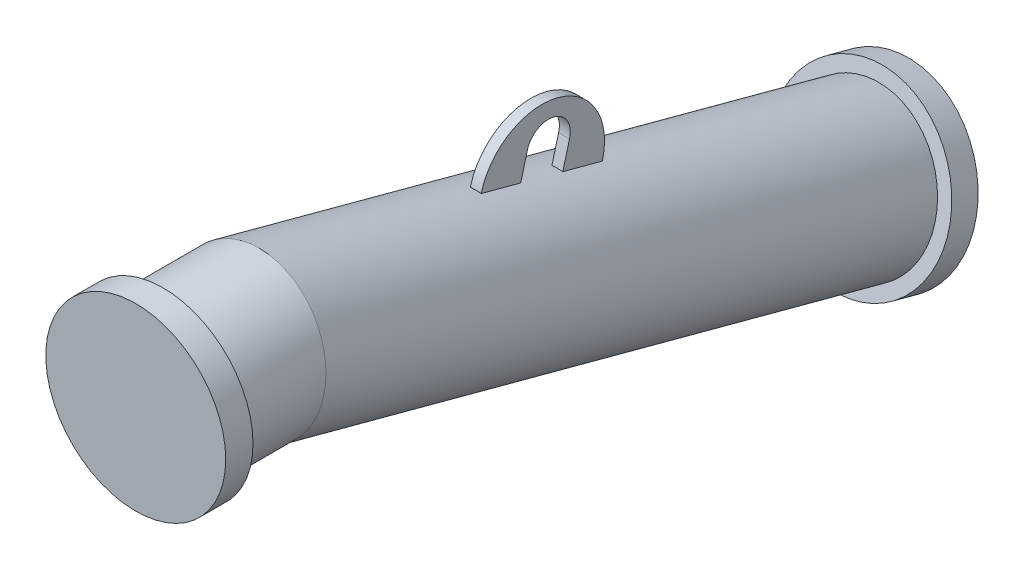
ISO-10303-21;
HEADER;
FILE_DESCRIPTION(('STEP AP214'),'2;1');
FILE_NAME('part.step','',(''),(''),'','','');
FILE_SCHEMA(('AUTOMOTIVE_DESIGN { 1 0 10303 214 1 1 1 1 }'));
ENDSEC;
DATA;
#1=APPLICATION_CONTEXT('core data for automotive mechanical design processes');
#2=APPLICATION_PROTOCOL_DEFINITION('international standard','automotive_design',2000,#1);
#3=PRODUCT_CONTEXT('',#1,'mechanical');
#4=PRODUCT('Part','Part','',(#3));
#5=PRODUCT_RELATED_PRODUCT_CATEGORY('part','',(#4));
#6=PRODUCT_DEFINITION_FORMATION('','',#4);
#7=PRODUCT_DEFINITION_CONTEXT('part definition',#1,'design');
#8=PRODUCT_DEFINITION('design','',#6,#7);
#9=PRODUCT_DEFINITION_SHAPE('','',#8);
#10=(LENGTH_UNIT() NAMED_UNIT(*) SI_UNIT(.MILLI.,.METRE.));
#11=(NAMED_UNIT(*) PLANE_ANGLE_UNIT() SI_UNIT($,.RADIAN.));
#12=(NAMED_UNIT(*) SI_UNIT($,.STERADIAN.) SOLID_ANGLE_UNIT());
#13=UNCERTAINTY_MEASURE_WITH_UNIT(LENGTH_MEASURE(1.E-05),#10,'distance_accuracy_value','');
#14=(GEOMETRIC_REPRESENTATION_CONTEXT(3) GLOBAL_UNCERTAINTY_ASSIGNED_CONTEXT((#13)) GLOBAL_UNIT_ASSIGNED_CONTEXT((#10,
#11,#12)) REPRESENTATION_CONTEXT('',''));
#15=CARTESIAN_POINT('',(0.,0.,0.));
#16=DIRECTION('',(0.,0.,1.));
#17=DIRECTION('',(1.,0.,0.));
#18=AXIS2_PLACEMENT_3D('',#15,#16,#17);
#19=CARTESIAN_POINT('',(-4.33536454895473E-11,-156.324502905385,-687.40248586322));
#20=DIRECTION('',(0.,-0.258819045102499,-0.965925826288988));
#21=DIRECTION('',(-1.00000000000005,0.,0.));
#22=AXIS2_PLACEMENT_3D('',#19,#20,#21);
#23=PLANE('',#22);
#24=CARTESIAN_POINT('',(-4.33536454895473E-11,-156.324502905385,-687.40248586322));
#25=DIRECTION('',(0.,-0.258819045102499,-0.965925826288988));
#26=DIRECTION('',(-1.00000000000005,0.,0.));
#27=AXIS2_PLACEMENT_3D('',#24,#25,#26);
#28=CIRCLE('',#27,82.5);
#29=CARTESIAN_POINT('',(-82.5000000000478,-156.324502905386,-687.402485863219));
#30=VERTEX_POINT('',#29);
#31=EDGE_CURVE('E20',#30,#30,#28,.T.);
#32=ORIENTED_EDGE('',*,*,#31,.T.);
#33=EDGE_LOOP('',(#32));
#34=FACE_BOUND('',#33,.T.);
#35=ADVANCED_FACE('F16',(#34),#23,.T.);
#36=CARTESIAN_POINT('',(-6.34812820856679E-13,-149.854026777807,-663.254340205998));
#37=DIRECTION('',(0.,-0.258819045102499,-0.965925826288988));
#38=DIRECTION('',(-1.00000000000005,0.,0.));
#39=AXIS2_PLACEMENT_3D('',#36,#37,#38);
#40=CYLINDRICAL_SURFACE('',#39,82.5);
#41=CARTESIAN_POINT('',(-6.34812820856679E-13,-149.854026777807,-663.254340205998));
#42=DIRECTION('',(0.,-0.258819045102499,-0.965925826288988));
#43=DIRECTION('',(-1.00000000000005,0.,0.));
#44=AXIS2_PLACEMENT_3D('',#41,#42,#43);
#45=CIRCLE('',#44,82.5);
#46=CARTESIAN_POINT('',(-82.5000000000051,-149.854026777808,-663.254340205997));
#47=VERTEX_POINT('',#46);
#48=EDGE_CURVE('E27',#47,#47,#45,.T.);
#49=ORIENTED_EDGE('',*,*,#48,.T.);
#50=EDGE_LOOP('',(#49));
#51=FACE_BOUND('',#50,.T.);
#52=ORIENTED_EDGE('',*,*,#31,.F.);
#53=EDGE_LOOP('',(#52));
#54=FACE_BOUND('',#53,.T.);
#55=ADVANCED_FACE('F18',(#51,#54),#40,.T.);
#56=CARTESIAN_POINT('',(-6.34812820856679E-13,-149.854026777807,-663.254340205998));
#57=DIRECTION('',(0.,-0.258819045102499,-0.965925826288988));
#58=DIRECTION('',(-1.00000000000005,0.,0.));
#59=AXIS2_PLACEMENT_3D('',#56,#57,#58);
#60=PLANE('',#59);
#61=CARTESIAN_POINT('',(-4.04398614430879E-11,-149.854026777835,-663.254340205991));
#62=DIRECTION('',(0.,0.258819045102523,0.965925826289025));
#63=DIRECTION('',(0.999999999999979,0.,0.));
#64=AXIS2_PLACEMENT_3D('',#61,#62,#63);
#65=CIRCLE('',#64,69.85);
#66=CARTESIAN_POINT('',(69.8499999999581,-149.854026777835,-663.254340205991));
#67=VERTEX_POINT('',#66);
#68=EDGE_CURVE('E10',#67,#67,#65,.T.);
#69=ORIENTED_EDGE('',*,*,#68,.F.);
#70=EDGE_LOOP('',(#69));
#71=FACE_BOUND('',#70,.T.);
#72=ORIENTED_EDGE('',*,*,#48,.F.);
#73=EDGE_LOOP('',(#72));
#74=FACE_BOUND('',#73,.T.);
#75=ADVANCED_FACE('F300',(#71,#74),#60,.F.);
#76=CARTESIAN_POINT('',(0.,0.,0.));
#77=DIRECTION('',(0.,0.,0.999999999999917));
#78=DIRECTION('',(1.00000000000005,0.,0.));
#79=AXIS2_PLACEMENT_3D('',#76,#77,#78);
#80=PLANE('',#79);
#81=CARTESIAN_POINT('',(0.,0.,0.));
#82=DIRECTION('',(0.,0.,0.999999999999917));
#83=DIRECTION('',(1.00000000000005,0.,0.));
#84=AXIS2_PLACEMENT_3D('',#81,#82,#83);
#85=CIRCLE('',#84,82.5);
#86=CARTESIAN_POINT('',(82.5000000000045,-8.30125381772403E-13,-2.88294578275769E-13));
#87=VERTEX_POINT('',#86);
#88=EDGE_CURVE('E278',#87,#87,#85,.T.);
#89=ORIENTED_EDGE('',*,*,#88,.T.);
#90=EDGE_LOOP('',(#89));
#91=FACE_BOUND('',#90,.T.);
#92=ADVANCED_FACE('F306',(#91),#80,.T.);
#93=CARTESIAN_POINT('',(-4.26333975374988E-11,1.61815005839117E-11,-24.9999999999994));
#94=DIRECTION('',(0.,0.,0.999999999999917));
#95=DIRECTION('',(1.00000000000005,0.,0.));
#96=AXIS2_PLACEMENT_3D('',#93,#94,#95);
#97=CYLINDRICAL_SURFACE('',#96,82.5);
#98=CARTESIAN_POINT('',(-4.26333975374988E-11,1.61815005839117E-11,-24.9999999999994));
#99=DIRECTION('',(0.,0.,0.999999999999917));
#100=DIRECTION('',(1.00000000000005,0.,0.));
#101=AXIS2_PLACEMENT_3D('',#98,#99,#100);
#102=CIRCLE('',#101,82.5);
#103=CARTESIAN_POINT('',(82.4999999999618,1.53513752021393E-11,-24.9999999999996));
#104=VERTEX_POINT('',#103);
#105=EDGE_CURVE('E252',#104,#104,#102,.T.);
#106=ORIENTED_EDGE('',*,*,#105,.T.);
#107=EDGE_LOOP('',(#106));
#108=FACE_BOUND('',#107,.T.);
#109=ORIENTED_EDGE('',*,*,#88,.F.);
#110=EDGE_LOOP('',(#109));
#111=FACE_BOUND('',#110,.T.);
#112=ADVANCED_FACE('F316',(#108,#111),#97,.T.);
#113=CARTESIAN_POINT('',(-4.26333975374988E-11,1.61815005839117E-11,-24.9999999999994));
#114=DIRECTION('',(0.,0.,0.999999999999917));
#115=DIRECTION('',(1.00000000000005,0.,0.));
#116=AXIS2_PLACEMENT_3D('',#113,#114,#115);
#117=PLANE('',#116);
#118=CARTESIAN_POINT('',(0.,0.,-24.999999999999));
#119=DIRECTION('',(0.,0.,-0.999999999999964));
#120=DIRECTION('',(-0.999999999999976,0.,0.));
#121=AXIS2_PLACEMENT_3D('',#118,#119,#120);
#122=CIRCLE('',#121,69.85);
#123=CARTESIAN_POINT('',(-69.8499999999983,-2.55500211454481E-13,-24.9999999999987));
#124=VERTEX_POINT('',#123);
#125=EDGE_CURVE('E249',#124,#124,#122,.T.);
#126=ORIENTED_EDGE('',*,*,#125,.F.);
#127=EDGE_LOOP('',(#126));
#128=FACE_BOUND('',#127,.T.);
#129=ORIENTED_EDGE('',*,*,#105,.F.);
#130=EDGE_LOOP('',(#129));
#131=FACE_BOUND('',#130,.T.);
#132=ADVANCED_FACE('F319',(#128,#131),#117,.F.);
#133=CARTESIAN_POINT('',(-4.04361456430874E-11,-129.409522551299,-586.954411696939));
#134=DIRECTION('',(0.,-0.258819045102523,-0.965925826289025));
#135=DIRECTION('',(-0.999999999999979,0.,0.));
#136=AXIS2_PLACEMENT_3D('',#133,#134,#135);
#137=CYLINDRICAL_SURFACE('',#136,69.85);
#138=CARTESIAN_POINT('',(-4.15916053734302E-11,-60.5614562174776,-330.009930136259));
#139=DIRECTION('',(0.,0.258819045102529,0.965925826289064));
#140=DIRECTION('',(0.,-0.965925826289066,0.25881904510253));
#141=AXIS2_PLACEMENT_3D('',#138,#139,#140);
#142=CIRCLE('',#141,69.85);
#143=CARTESIAN_POINT('',(4.999999999959,6.73538358774536,-348.042064015247));
#144=VERTEX_POINT('',#143);
#145=CARTESIAN_POINT('',(-5.000000000041,6.73538358774543,-348.042064015247));
#146=VERTEX_POINT('',#145);
#147=EDGE_CURVE('E268',#144,#146,#142,.T.);
#148=ORIENTED_EDGE('',*,*,#147,.F.);
#149=DIRECTION('',(0.,-0.258819045102523,-0.965925826289025));
#150=VECTOR('',#149,1.);
#151=CARTESIAN_POINT('',(4.99999999995958,-62.1126827460732,-604.986545575916));
#152=LINE('',#151,#150);
#153=CARTESIAN_POINT('',(4.99999999995958,16.4410977790958,-311.819845529398));
#154=VERTEX_POINT('',#153);
#155=EDGE_CURVE('E264',#144,#154,#152,.F.);
#156=ORIENTED_EDGE('',*,*,#155,.T.);
#157=CARTESIAN_POINT('',(-4.17544939264353E-11,-50.8557420261328,-293.787711650419));
#158=DIRECTION('',(0.,-0.258819045102529,-0.965925826289066));
#159=DIRECTION('',(0.,0.965925826289066,-0.258819045102529));
#160=AXIS2_PLACEMENT_3D('',#157,#158,#159);
#161=CIRCLE('',#160,69.85);
#162=CARTESIAN_POINT('',(-5.00000000004043,16.441097779096,-311.819845529398));
#163=VERTEX_POINT('',#162);
#164=EDGE_CURVE('E256',#163,#154,#161,.T.);
#165=ORIENTED_EDGE('',*,*,#164,.F.);
#166=DIRECTION('',(0.,-0.258819045102523,-0.965925826289025));
#167=VECTOR('',#166,1.);
#168=CARTESIAN_POINT('',(-5.00000000004043,-62.1126827460732,-604.986545575916));
#169=LINE('',#168,#167);
#170=EDGE_CURVE('E260',#146,#163,#169,.F.);
#171=ORIENTED_EDGE('',*,*,#170,.F.);
#172=EDGE_LOOP('',(#148,#156,#165,#171));
#173=FACE_BOUND('',#172,.T.);
#174=ORIENTED_EDGE('',*,*,#68,.T.);
#175=EDGE_LOOP('',(#174));
#176=FACE_BOUND('',#175,.T.);
#177=CARTESIAN_POINT('',(0.,-1.73056013963446E-11,-103.991498552409));
#178=DIRECTION('',(0.,-0.130526192220051,-0.991444861373775));
#179=DIRECTION('',(0.,-0.991444861373834,0.130526192220052));
#180=AXIS2_PLACEMENT_3D('',#177,#178,#179);
#181=ELLIPSE('',#180,70.4527328965237,69.85);
#182=CARTESIAN_POINT('',(-2.96148545480706E-13,-69.850000000019,-94.7955715959296));
#183=VERTEX_POINT('',#182);
#184=EDGE_CURVE('E247',#183,#183,#181,.T.);
#185=ORIENTED_EDGE('',*,*,#184,.T.);
#186=EDGE_LOOP('',(#185));
#187=FACE_BOUND('',#186,.T.);
#188=CARTESIAN_POINT('',(-4.14178575835581E-11,-70.9142180215791,-368.646963187822));
#189=DIRECTION('',(0.,-0.258819045102529,-0.965925826289064));
#190=DIRECTION('',(0.,0.965925826289066,-0.258819045102529));
#191=AXIS2_PLACEMENT_3D('',#188,#189,#190);
#192=CIRCLE('',#191,69.85);
#193=CARTESIAN_POINT('',(-5.00000000004092,-3.6173782163557,-386.679097066808));
#194=VERTEX_POINT('',#193);
#195=CARTESIAN_POINT('',(4.99999999995909,-3.61737821635567,-386.679097066808));
#196=VERTEX_POINT('',#195);
#197=EDGE_CURVE('E48',#194,#196,#192,.T.);
#198=ORIENTED_EDGE('',*,*,#197,.F.);
#199=CARTESIAN_POINT('',(-5.00000000004042,-13.3230924076954,-422.90131555264));
#200=VERTEX_POINT('',#199);
#201=EDGE_CURVE('E265',#200,#194,#169,.F.);
#202=ORIENTED_EDGE('',*,*,#201,.F.);
#203=CARTESIAN_POINT('',(-4.1254969030553E-11,-80.6199322129241,-404.869181673662));
#204=DIRECTION('',(0.,0.258819045102529,0.965925826289066));
#205=DIRECTION('',(0.,-0.965925826289066,0.258819045102529));
#206=AXIS2_PLACEMENT_3D('',#203,#204,#205);
#207=CIRCLE('',#206,69.85);
#208=CARTESIAN_POINT('',(4.99999999995958,-13.3230924076955,-422.90131555264));
#209=VERTEX_POINT('',#208);
#210=EDGE_CURVE('E272',#209,#200,#207,.T.);
#211=ORIENTED_EDGE('',*,*,#210,.F.);
#212=EDGE_CURVE('E40',#209,#196,#152,.F.);
#213=ORIENTED_EDGE('',*,*,#212,.T.);
#214=EDGE_LOOP('',(#198,#202,#211,#213));
#215=FACE_BOUND('',#214,.T.);
#216=ADVANCED_FACE('F325',(#173,#176,#187,#215),#137,.T.);
#217=CARTESIAN_POINT('',(0.,-1.73056013963446E-11,-103.991498552409));
#218=DIRECTION('',(0.,0.,0.999999999999964));
#219=DIRECTION('',(0.999999999999976,0.,0.));
#220=AXIS2_PLACEMENT_3D('',#217,#218,#219);
#221=CYLINDRICAL_SURFACE('',#220,69.85);
#222=ORIENTED_EDGE('',*,*,#125,.T.);
#223=EDGE_LOOP('',(#222));
#224=FACE_BOUND('',#223,.T.);
#225=ORIENTED_EDGE('',*,*,#184,.F.);
#226=EDGE_LOOP('',(#225));
#227=FACE_BOUND('',#226,.T.);
#228=ADVANCED_FACE('F327',(#224,#227),#221,.T.);
#229=CARTESIAN_POINT('',(4.99999999995958,24.576227638515,-373.528027379131));
#230=DIRECTION('',(1.,0.,0.));
#231=DIRECTION('',(0.,0.965925826289068,-0.25881904510253));
#232=AXIS2_PLACEMENT_3D('',#229,#230,#231);
#233=PLANE('',#232);
#234=ORIENTED_EDGE('',*,*,#212,.F.);
#235=DIRECTION('',(0.,0.965925826289066,-0.258819045102529));
#236=VECTOR('',#235,1.);
#237=CARTESIAN_POINT('',(4.99999999995958,-22.6643826355643,-420.398324379818));
#238=LINE('',#237,#236);
#239=CARTESIAN_POINT('',(4.99999999995958,-13.0051243726735,-422.986514830843));
#240=VERTEX_POINT('',#239);
#241=EDGE_CURVE('E198',#209,#240,#238,.T.);
#242=ORIENTED_EDGE('',*,*,#241,.T.);
#243=CARTESIAN_POINT('',(4.99999999995958,1.87697072072196,-367.445779819222));
#244=DIRECTION('',(1.,0.,0.));
#245=DIRECTION('',(0.,0.965925826289068,-0.25881904510253));
#246=AXIS2_PLACEMENT_3D('',#243,#244,#245);
#247=CIRCLE('',#246,57.5);
#248=CARTESIAN_POINT('',(4.99999999995958,16.7590658141172,-311.9050448076));
#249=VERTEX_POINT('',#248);
#250=EDGE_CURVE('E216',#240,#249,#247,.T.);
#251=ORIENTED_EDGE('',*,*,#250,.T.);
#252=DIRECTION('',(0.,0.965925826289066,-0.258819045102529));
#253=VECTOR('',#252,1.);
#254=CARTESIAN_POINT('',(4.99999999995957,7.09980755122653,-309.316854356575));
#255=LINE('',#254,#253);
#256=EDGE_CURVE('E185',#154,#249,#255,.T.);
#257=ORIENTED_EDGE('',*,*,#256,.F.);
#258=ORIENTED_EDGE('',*,*,#155,.F.);
#259=DIRECTION('',(0.,0.965925826289068,-0.25881904510253));
#260=VECTOR('',#259,1.);
#261=CARTESIAN_POINT('',(4.99999999995958,7.05335162277241,-348.12726329344));
#262=LINE('',#261,#260);
#263=CARTESIAN_POINT('',(4.99999999995958,29.7526085405658,-354.20951085335));
#264=VERTEX_POINT('',#263);
#265=EDGE_CURVE('E205',#144,#264,#262,.T.);
#266=ORIENTED_EDGE('',*,*,#265,.T.);
#267=CARTESIAN_POINT('',(4.99999999995958,24.576227638515,-373.528027379131));
#268=DIRECTION('',(-1.,0.,0.));
#269=DIRECTION('',(0.,0.965925826289068,-0.25881904510253));
#270=AXIS2_PLACEMENT_3D('',#267,#268,#269);
#271=CIRCLE('',#270,20.);
#272=CARTESIAN_POINT('',(4.99999999995958,19.3998467364645,-392.846543904913));
#273=VERTEX_POINT('',#272);
#274=EDGE_CURVE('E208',#264,#273,#271,.T.);
#275=ORIENTED_EDGE('',*,*,#274,.T.);
#276=DIRECTION('',(0.,-0.965925826289068,0.25881904510253));
#277=VECTOR('',#276,1.);
#278=CARTESIAN_POINT('',(4.99999999995958,-3.29941018132864,-386.764296345003));
#279=LINE('',#278,#277);
#280=EDGE_CURVE('E212',#273,#196,#279,.T.);
#281=ORIENTED_EDGE('',*,*,#280,.T.);
#282=EDGE_LOOP('',(#234,#242,#251,#257,#258,#266,#275,#281));
#283=FACE_BOUND('',#282,.T.);
#284=ADVANCED_FACE('F330',(#283),#233,.T.);
#285=CARTESIAN_POINT('',(-5.00000000004042,24.576227638515,-373.528027379131));
#286=DIRECTION('',(1.,0.,0.));
#287=DIRECTION('',(0.,0.965925826289068,-0.25881904510253));
#288=AXIS2_PLACEMENT_3D('',#285,#286,#287);
#289=PLANE('',#288);
#290=DIRECTION('',(0.,0.965925826289066,-0.258819045102529));
#291=VECTOR('',#290,1.);
#292=CARTESIAN_POINT('',(-5.00000000004042,-22.6643826355643,-420.398324379818));
#293=LINE('',#292,#291);
#294=CARTESIAN_POINT('',(-5.00000000004042,-13.0051243726736,-422.986514830843));
#295=VERTEX_POINT('',#294);
#296=EDGE_CURVE('E201',#200,#295,#293,.T.);
#297=ORIENTED_EDGE('',*,*,#296,.F.);
#298=ORIENTED_EDGE('',*,*,#201,.T.);
#299=DIRECTION('',(0.,-0.965925826289068,0.25881904510253));
#300=VECTOR('',#299,1.);
#301=CARTESIAN_POINT('',(-5.00000000004042,-3.2994101813286,-386.764296345003));
#302=LINE('',#301,#300);
#303=CARTESIAN_POINT('',(-5.00000000004042,19.3998467364645,-392.846543904913));
#304=VERTEX_POINT('',#303);
#305=EDGE_CURVE('E226',#304,#194,#302,.T.);
#306=ORIENTED_EDGE('',*,*,#305,.F.);
#307=CARTESIAN_POINT('',(-5.00000000004042,24.576227638515,-373.528027379131));
#308=DIRECTION('',(-1.,0.,0.));
#309=DIRECTION('',(0.,0.965925826289068,-0.25881904510253));
#310=AXIS2_PLACEMENT_3D('',#307,#308,#309);
#311=CIRCLE('',#310,20.);
#312=CARTESIAN_POINT('',(-5.00000000004042,29.7526085405658,-354.20951085335));
#313=VERTEX_POINT('',#312);
#314=EDGE_CURVE('E223',#313,#304,#311,.T.);
#315=ORIENTED_EDGE('',*,*,#314,.F.);
#316=DIRECTION('',(0.,0.965925826289068,-0.25881904510253));
#317=VECTOR('',#316,1.);
#318=CARTESIAN_POINT('',(-5.00000000004042,7.05335162277244,-348.12726329344));
#319=LINE('',#318,#317);
#320=EDGE_CURVE('E204',#146,#313,#319,.T.);
#321=ORIENTED_EDGE('',*,*,#320,.F.);
#322=ORIENTED_EDGE('',*,*,#170,.T.);
#323=DIRECTION('',(0.,0.965925826289066,-0.258819045102529));
#324=VECTOR('',#323,1.);
#325=CARTESIAN_POINT('',(-5.00000000004043,7.09980755122653,-309.316854356575));
#326=LINE('',#325,#324);
#327=CARTESIAN_POINT('',(-5.00000000004042,16.7590658141172,-311.9050448076));
#328=VERTEX_POINT('',#327);
#329=EDGE_CURVE('E195',#163,#328,#326,.T.);
#330=ORIENTED_EDGE('',*,*,#329,.T.);
#331=CARTESIAN_POINT('',(-5.00000000004042,1.87697072072199,-367.445779819222));
#332=DIRECTION('',(1.,0.,0.));
#333=DIRECTION('',(0.,0.965925826289068,-0.25881904510253));
#334=AXIS2_PLACEMENT_3D('',#331,#332,#333);
#335=CIRCLE('',#334,57.5);
#336=EDGE_CURVE('E209',#295,#328,#335,.T.);
#337=ORIENTED_EDGE('',*,*,#336,.F.);
#338=EDGE_LOOP('',(#297,#298,#306,#315,#321,#322,#330,#337));
#339=FACE_BOUND('',#338,.T.);
#340=ADVANCED_FACE('F338',(#339),#289,.F.);
#341=CARTESIAN_POINT('',(4.99999999995958,7.05335162277241,-348.12726329344));
#342=DIRECTION('',(0.,0.258819045102529,0.965925826289064));
#343=DIRECTION('',(0.,-0.965925826289068,0.25881904510253));
#344=AXIS2_PLACEMENT_3D('',#341,#342,#343);
#345=PLANE('',#344);
#346=ORIENTED_EDGE('',*,*,#265,.F.);
#347=ORIENTED_EDGE('',*,*,#147,.T.);
#348=ORIENTED_EDGE('',*,*,#320,.T.);
#349=DIRECTION('',(-1.,0.,0.));
#350=VECTOR('',#349,1.);
#351=CARTESIAN_POINT('',(4.99999999995958,29.7526085405658,-354.20951085335));
#352=LINE('',#351,#350);
#353=EDGE_CURVE('E244',#264,#313,#352,.T.);
#354=ORIENTED_EDGE('',*,*,#353,.F.);
#355=EDGE_LOOP('',(#346,#347,#348,#354));
#356=FACE_BOUND('',#355,.T.);
#357=ADVANCED_FACE('F335',(#356),#345,.F.);
#358=CARTESIAN_POINT('',(4.99999999995958,24.576227638515,-373.528027379131));
#359=DIRECTION('',(-1.,0.,0.));
#360=DIRECTION('',(0.,-0.965925826289068,0.25881904510253));
#361=AXIS2_PLACEMENT_3D('',#358,#359,#360);
#362=CYLINDRICAL_SURFACE('',#361,20.);
#363=ORIENTED_EDGE('',*,*,#314,.T.);
#364=DIRECTION('',(-1.,0.,0.));
#365=VECTOR('',#364,1.);
#366=CARTESIAN_POINT('',(4.99999999995958,19.3998467364645,-392.846543904913));
#367=LINE('',#366,#365);
#368=EDGE_CURVE('E240',#273,#304,#367,.T.);
#369=ORIENTED_EDGE('',*,*,#368,.F.);
#370=ORIENTED_EDGE('',*,*,#274,.F.);
#371=ORIENTED_EDGE('',*,*,#353,.T.);
#372=EDGE_LOOP('',(#363,#369,#370,#371));
#373=FACE_BOUND('',#372,.T.);
#374=ADVANCED_FACE('F337',(#373),#362,.F.);
#375=CARTESIAN_POINT('',(4.99999999995958,-3.29941018132864,-386.764296345003));
#376=DIRECTION('',(0.,-0.258819045102529,-0.965925826289064));
#377=DIRECTION('',(0.,0.965925826289068,-0.25881904510253));
#378=AXIS2_PLACEMENT_3D('',#375,#376,#377);
#379=PLANE('',#378);
#380=ORIENTED_EDGE('',*,*,#305,.T.);
#381=ORIENTED_EDGE('',*,*,#197,.T.);
#382=ORIENTED_EDGE('',*,*,#280,.F.);
#383=ORIENTED_EDGE('',*,*,#368,.T.);
#384=EDGE_LOOP('',(#380,#381,#382,#383));
#385=FACE_BOUND('',#384,.T.);
#386=ADVANCED_FACE('F342',(#385),#379,.F.);
#387=CARTESIAN_POINT('',(4.99999999995958,1.87697072072196,-367.445779819222));
#388=DIRECTION('',(-1.,0.,0.));
#389=DIRECTION('',(0.,-0.965925826289068,0.25881904510253));
#390=AXIS2_PLACEMENT_3D('',#387,#388,#389);
#391=CYLINDRICAL_SURFACE('',#390,57.5);
#392=ORIENTED_EDGE('',*,*,#336,.T.);
#393=DIRECTION('',(-1.,0.,0.));
#394=VECTOR('',#393,1.);
#395=CARTESIAN_POINT('',(4.99999999995958,16.7590658141172,-311.9050448076));
#396=LINE('',#395,#394);
#397=EDGE_CURVE('E220',#249,#328,#396,.T.);
#398=ORIENTED_EDGE('',*,*,#397,.F.);
#399=ORIENTED_EDGE('',*,*,#250,.F.);
#400=DIRECTION('',(-1.,0.,0.));
#401=VECTOR('',#400,1.);
#402=CARTESIAN_POINT('',(4.99999999995958,-13.0051243726735,-422.986514830843));
#403=LINE('',#402,#401);
#404=EDGE_CURVE('E236',#240,#295,#403,.T.);
#405=ORIENTED_EDGE('',*,*,#404,.T.);
#406=EDGE_LOOP('',(#392,#398,#399,#405));
#407=FACE_BOUND('',#406,.T.);
#408=ADVANCED_FACE('F346',(#407),#391,.T.);
#409=CARTESIAN_POINT('',(-5.00000000004042,-22.6643826355643,-420.398324379818));
#410=DIRECTION('',(0.,0.258819045102529,0.965925826289066));
#411=DIRECTION('',(0.,-0.965925826289066,0.258819045102529));
#412=AXIS2_PLACEMENT_3D('',#409,#410,#411);
#413=PLANE('',#412);
#414=ORIENTED_EDGE('',*,*,#241,.F.);
#415=ORIENTED_EDGE('',*,*,#210,.T.);
#416=ORIENTED_EDGE('',*,*,#296,.T.);
#417=ORIENTED_EDGE('',*,*,#404,.F.);
#418=EDGE_LOOP('',(#414,#415,#416,#417));
#419=FACE_BOUND('',#418,.T.);
#420=ADVANCED_FACE('F350',(#419),#413,.F.);
#421=CARTESIAN_POINT('',(4.99999999995957,7.09980755122653,-309.316854356575));
#422=DIRECTION('',(0.,-0.258819045102529,-0.965925826289066));
#423=DIRECTION('',(0.,0.965925826289066,-0.258819045102529));
#424=AXIS2_PLACEMENT_3D('',#421,#422,#423);
#425=PLANE('',#424);
#426=ORIENTED_EDGE('',*,*,#329,.F.);
#427=ORIENTED_EDGE('',*,*,#164,.T.);
#428=ORIENTED_EDGE('',*,*,#256,.T.);
#429=ORIENTED_EDGE('',*,*,#397,.T.);
#430=EDGE_LOOP('',(#426,#427,#428,#429));
#431=FACE_BOUND('',#430,.T.);
#432=ADVANCED_FACE('F360',(#431),#425,.F.);
#433=CLOSED_SHELL('',(#35,#55,#75,#92,#112,#132,#216,#228,#284,#340,#357,#374,#386,#408,#420,#432));
#434=CARTESIAN_POINT('',(0.,0.,-25.));
#435=DIRECTION('',(0.,0.,1.));
#436=DIRECTION('',(1.,0.,0.));
#437=AXIS2_PLACEMENT_3D('',#434,#435,#436);
#438=PLANE('',#437);
#439=CARTESIAN_POINT('',(0.,1.11022302462519E-13,-24.999999999999));
#440=DIRECTION('',(0.,0.,-1.));
#441=DIRECTION('',(0.,1.,0.));
#442=AXIS2_PLACEMENT_3D('',#439,#440,#441);
#443=CIRCLE('',#442,27.);
#444=CARTESIAN_POINT('',(0.,27.0000000000001,-24.999999999999));
#445=VERTEX_POINT('',#444);
#446=EDGE_CURVE('E186',#445,#445,#443,.T.);
#447=ORIENTED_EDGE('',*,*,#446,.T.);
#448=EDGE_LOOP('',(#447));
#449=FACE_BOUND('',#448,.T.);
#450=ADVANCED_FACE('F369',(#449),#438,.F.);
#451=CARTESIAN_POINT('',(0.,-600.,-24.999999999999));
#452=DIRECTION('',(-1.,0.,0.));
#453=DIRECTION('',(0.,0.,1.));
#454=AXIS2_PLACEMENT_3D('',#451,#452,#453);
#455=TOROIDAL_SURFACE('',#454,600.,27.);
#456=CARTESIAN_POINT('',(-7.07291010546012E-13,-20.444504226546,-180.291427061463));
#457=DIRECTION('',(0.,0.258819045102522,0.96592582628907));
#458=DIRECTION('',(0.997079084336691,-0.0737735901288823,0.0197675738977788));
#459=AXIS2_PLACEMENT_3D('',#456,#457,#458);
#460=CIRCLE('',#459,27.);
#461=CARTESIAN_POINT('',(-7.39119106020582E-13,5.6354930832595,-187.279541279229));
#462=VERTEX_POINT('',#461);
#463=EDGE_CURVE('E180',#462,#462,#460,.T.);
#464=CARTESIAN_POINT('',(0.,-600.,-24.999999999999));
#465=DIRECTION('',(-1.,0.,0.));
#466=DIRECTION('',(0.,0.,1.));
#467=AXIS2_PLACEMENT_3D('',#464,#465,#466);
#468=CIRCLE('',#467,627.);
#469=EDGE_CURVE('',#445,#462,#468,.T.);
#470=ORIENTED_EDGE('',*,*,#446,.F.);
#471=ORIENTED_EDGE('',*,*,#463,.F.);
#472=ORIENTED_EDGE('',*,*,#469,.T.);
#473=ORIENTED_EDGE('',*,*,#469,.F.);
#474=EDGE_LOOP('',(#470,#472,#471,#473));
#475=FACE_BOUND('',#474,.T.);
#476=ADVANCED_FACE('F365',(#475),#455,.F.);
#477=CARTESIAN_POINT('',(-7.07291010546012E-13,-20.444504226546,-180.291427061463));
#478=DIRECTION('',(0.,-0.258819045102522,-0.96592582628907));
#479=DIRECTION('',(-0.997079084336691,0.0737735901288823,-0.0197675738977788));
#480=AXIS2_PLACEMENT_3D('',#477,#478,#479);
#481=CYLINDRICAL_SURFACE('',#480,27.);
#482=ORIENTED_EDGE('',*,*,#463,.T.);
#483=EDGE_LOOP('',(#482));
#484=FACE_BOUND('',#483,.T.);
#485=CARTESIAN_POINT('',(-6.66568137547672E-13,-155.030407679856,-682.572856731775));
#486=DIRECTION('',(0.,0.258819045102499,0.965925826288988));
#487=DIRECTION('',(0.,-0.965925826289068,0.258819045102521));
#488=AXIS2_PLACEMENT_3D('',#485,#486,#487);
#489=CIRCLE('',#488,27.);
#490=CARTESIAN_POINT('',(-6.66568137547672E-13,-181.110404989661,-675.584742514007));
#491=VERTEX_POINT('',#490);
#492=EDGE_CURVE('E181',#491,#491,#489,.T.);
#493=ORIENTED_EDGE('',*,*,#492,.F.);
#494=EDGE_LOOP('',(#493));
#495=FACE_BOUND('',#494,.T.);
#496=ADVANCED_FACE('F368',(#484,#495),#481,.F.);
#497=CARTESIAN_POINT('',(4.72578070244824E-11,-155.030407679901,-682.572856731763));
#498=DIRECTION('',(0.,0.258819045102499,0.965925826288988));
#499=DIRECTION('',(1.00000000000005,0.,0.));
#500=AXIS2_PLACEMENT_3D('',#497,#498,#499);
#501=PLANE('',#500);
#502=ORIENTED_EDGE('',*,*,#492,.T.);
#503=EDGE_LOOP('',(#502));
#504=FACE_BOUND('',#503,.T.);
#505=ADVANCED_FACE('F374',(#504),#501,.T.);
#506=CLOSED_SHELL('',(#450,#476,#496,#505));
#507=CARTESIAN_POINT('',(-44.1941738242024,44.1941738242918,-20.000000000036));
#508=DIRECTION('',(0.,0.,0.999999999999917));
#509=DIRECTION('',(0.,-1.,0.));
#510=AXIS2_PLACEMENT_3D('',#507,#508,#509);
#511=PLANE('',#510);
#512=CARTESIAN_POINT('',(-44.1941738242024,44.1941738242918,-20.000000000036));
#513=DIRECTION('',(0.,0.,0.999999999999917));
#514=DIRECTION('',(1.00000000000005,0.,0.));
#515=AXIS2_PLACEMENT_3D('',#512,#513,#514);
#516=CIRCLE('',#515,7.);
#517=CARTESIAN_POINT('',(-37.194173824202,44.1941738242918,-20.000000000036));
#518=VERTEX_POINT('',#517);
#519=EDGE_CURVE('E147',#518,#518,#516,.T.);
#520=ORIENTED_EDGE('',*,*,#519,.F.);
#521=EDGE_LOOP('',(#520));
#522=FACE_BOUND('',#521,.T.);
#523=ADVANCED_FACE('F412',(#522),#511,.F.);
#524=CARTESIAN_POINT('',(-44.1941738242024,44.1941738242918,-20.000000000036));
#525=DIRECTION('',(0.,0.,0.999999999999917));
#526=DIRECTION('',(1.00000000000005,0.,0.));
#527=AXIS2_PLACEMENT_3D('',#524,#525,#526);
#528=CONICAL_SURFACE('',#527,7.,1.02974425867665);
#529=CARTESIAN_POINT('',(-44.1941738242023,44.1941738243044,-24.2060243332213));
#530=VERTEX_POINT('',#529);
#531=VERTEX_LOOP('',#530);
#532=FACE_BOUND('',#531,.T.);
#533=ORIENTED_EDGE('',*,*,#519,.T.);
#534=EDGE_LOOP('',(#533));
#535=FACE_BOUND('',#534,.T.);
#536=ADVANCED_FACE('F415',(#532,#535),#528,.F.);
#537=CLOSED_SHELL('',(#523,#536));
#538=CARTESIAN_POINT('',(44.1941738241963,-193.836415871471,-656.645675469215));
#539=DIRECTION('',(0.,-0.258819045102499,-0.965925826288988));
#540=DIRECTION('',(0.,0.965925826289068,-0.258819045102521));
#541=AXIS2_PLACEMENT_3D('',#538,#539,#540);
#542=PLANE('',#541);
#543=CARTESIAN_POINT('',(44.1941738241963,-193.836415871471,-656.645675469215));
#544=DIRECTION('',(0.,-0.258819045102499,-0.965925826288988));
#545=DIRECTION('',(-1.00000000000005,0.,0.));
#546=AXIS2_PLACEMENT_3D('',#543,#544,#545);
#547=CIRCLE('',#546,6.99999999999999);
#548=CARTESIAN_POINT('',(37.1941738241959,-193.836415871472,-656.645675469215));
#549=VERTEX_POINT('',#548);
#550=EDGE_CURVE('E156',#549,#549,#547,.T.);
#551=ORIENTED_EDGE('',*,*,#550,.F.);
#552=EDGE_LOOP('',(#551));
#553=FACE_BOUND('',#552,.T.);
#554=ADVANCED_FACE('F422',(#553),#542,.F.);
#555=CARTESIAN_POINT('',(44.1941738241963,-193.836415871471,-656.645675469215));
#556=DIRECTION('',(0.,-0.258819045102499,-0.965925826288988));
#557=DIRECTION('',(-1.00000000000005,0.,0.));
#558=AXIS2_PLACEMENT_3D('',#555,#556,#557);
#559=CONICAL_SURFACE('',#558,6.99999999999999,1.02974425867665);
#560=CARTESIAN_POINT('',(44.1941738242372,-192.747816669874,-652.582967939781));
#561=VERTEX_POINT('',#560);
#562=VERTEX_LOOP('',#561);
#563=FACE_BOUND('',#562,.T.);
#564=ORIENTED_EDGE('',*,*,#550,.T.);
#565=EDGE_LOOP('',(#564));
#566=FACE_BOUND('',#565,.T.);
#567=ADVANCED_FACE('F425',(#563,#566),#559,.F.);
#568=CLOSED_SHELL('',(#554,#567));
#569=CARTESIAN_POINT('',(-44.1941738241228,-193.836415871577,-656.645675469215));
#570=DIRECTION('',(0.,-0.258819045102499,-0.965925826288988));
#571=DIRECTION('',(0.,0.965925826289068,-0.258819045102521));
#572=AXIS2_PLACEMENT_3D('',#569,#570,#571);
#573=PLANE('',#572);
#574=CARTESIAN_POINT('',(-44.1941738241228,-193.836415871577,-656.645675469215));
#575=DIRECTION('',(0.,-0.258819045102499,-0.965925826288988));
#576=DIRECTION('',(-1.00000000000005,0.,0.));
#577=AXIS2_PLACEMENT_3D('',#574,#575,#576);
#578=CIRCLE('',#577,7.);
#579=CARTESIAN_POINT('',(-51.1941738241232,-193.836415871577,-656.645675469215));
#580=VERTEX_POINT('',#579);
#581=EDGE_CURVE('E168',#580,#580,#578,.T.);
#582=ORIENTED_EDGE('',*,*,#581,.F.);
#583=EDGE_LOOP('',(#582));
#584=FACE_BOUND('',#583,.T.);
#585=ADVANCED_FACE('F392',(#584),#573,.F.);
#586=CARTESIAN_POINT('',(-44.1941738241228,-193.836415871577,-656.645675469215));
#587=DIRECTION('',(0.,-0.258819045102499,-0.965925826288988));
#588=DIRECTION('',(-1.00000000000005,0.,0.));
#589=AXIS2_PLACEMENT_3D('',#586,#587,#588);
#590=CONICAL_SURFACE('',#589,7.,1.02974425867665);
#591=CARTESIAN_POINT('',(-44.194173824082,-192.747816670011,-652.582967939789));
#592=VERTEX_POINT('',#591);
#593=VERTEX_LOOP('',#592);
#594=FACE_BOUND('',#593,.T.);
#595=ORIENTED_EDGE('',*,*,#581,.T.);
#596=EDGE_LOOP('',(#595));
#597=FACE_BOUND('',#596,.T.);
#598=ADVANCED_FACE('F395',(#594,#597),#590,.F.);
#599=CLOSED_SHELL('',(#585,#598));
#600=CARTESIAN_POINT('',(-44.1941738241601,-108.459828135055,-679.522263205699));
#601=DIRECTION('',(0.,-0.258819045102499,-0.965925826288988));
#602=DIRECTION('',(0.,0.965925826289068,-0.258819045102521));
#603=AXIS2_PLACEMENT_3D('',#600,#601,#602);
#604=PLANE('',#603);
#605=CARTESIAN_POINT('',(-44.1941738241601,-108.459828135055,-679.522263205699));
#606=DIRECTION('',(0.,-0.258819045102499,-0.965925826288988));
#607=DIRECTION('',(-1.00000000000005,0.,0.));
#608=AXIS2_PLACEMENT_3D('',#605,#606,#607);
#609=CIRCLE('',#608,7.);
#610=CARTESIAN_POINT('',(-51.1941738241604,-108.459828135055,-679.522263205699));
#611=VERTEX_POINT('',#610);
#612=EDGE_CURVE('E170',#611,#611,#609,.T.);
#613=ORIENTED_EDGE('',*,*,#612,.F.);
#614=EDGE_LOOP('',(#613));
#615=FACE_BOUND('',#614,.T.);
#616=ADVANCED_FACE('F402',(#615),#604,.F.);
#617=CARTESIAN_POINT('',(-44.1941738241601,-108.459828135055,-679.522263205699));
#618=DIRECTION('',(0.,-0.258819045102499,-0.965925826288988));
#619=DIRECTION('',(-1.00000000000005,0.,0.));
#620=AXIS2_PLACEMENT_3D('',#617,#618,#619);
#621=CONICAL_SURFACE('',#620,7.,1.02974425867665);
#622=CARTESIAN_POINT('',(-44.1941738241602,-107.371228933474,-675.459555676277));
#623=VERTEX_POINT('',#622);
#624=VERTEX_LOOP('',#623);
#625=FACE_BOUND('',#624,.T.);
#626=ORIENTED_EDGE('',*,*,#612,.T.);
#627=EDGE_LOOP('',(#626));
#628=FACE_BOUND('',#627,.T.);
#629=ADVANCED_FACE('F405',(#625,#628),#621,.F.);
#630=CLOSED_SHELL('',(#616,#629));
#631=CARTESIAN_POINT('',(44.1941738241168,44.1941738241748,-20.0000000000062));
#632=DIRECTION('',(0.,0.,0.999999999999917));
#633=DIRECTION('',(0.,-1.,0.));
#634=AXIS2_PLACEMENT_3D('',#631,#632,#633);
#635=PLANE('',#634);
#636=CARTESIAN_POINT('',(44.1941738241168,44.1941738241748,-20.0000000000062));
#637=DIRECTION('',(0.,0.,0.999999999999917));
#638=DIRECTION('',(1.00000000000005,0.,0.));
#639=AXIS2_PLACEMENT_3D('',#636,#637,#638);
#640=CIRCLE('',#639,7.);
#641=CARTESIAN_POINT('',(51.1941738241172,44.1941738241747,-20.0000000000063));
#642=VERTEX_POINT('',#641);
#643=EDGE_CURVE('E144',#642,#642,#640,.T.);
#644=ORIENTED_EDGE('',*,*,#643,.F.);
#645=EDGE_LOOP('',(#644));
#646=FACE_BOUND('',#645,.T.);
#647=ADVANCED_FACE('F138',(#646),#635,.F.);
#648=CARTESIAN_POINT('',(44.1941738241168,44.1941738241748,-20.0000000000062));
#649=DIRECTION('',(0.,0.,0.999999999999917));
#650=DIRECTION('',(1.00000000000005,0.,0.));
#651=AXIS2_PLACEMENT_3D('',#648,#649,#650);
#652=CONICAL_SURFACE('',#651,7.,1.02974425867665);
#653=CARTESIAN_POINT('',(44.1941738241169,44.1941738241632,-24.2060243331873));
#654=VERTEX_POINT('',#653);
#655=VERTEX_LOOP('',#654);
#656=FACE_BOUND('',#655,.T.);
#657=ORIENTED_EDGE('',*,*,#643,.T.);
#658=EDGE_LOOP('',(#657));
#659=FACE_BOUND('',#658,.T.);
#660=ADVANCED_FACE('F135',(#656,#659),#652,.F.);
#661=CLOSED_SHELL('',(#647,#660));
#662=CARTESIAN_POINT('',(44.1941738240796,-44.1941738241277,-19.9999999999665));
#663=DIRECTION('',(0.,0.,0.999999999999917));
#664=DIRECTION('',(0.,-1.,0.));
#665=AXIS2_PLACEMENT_3D('',#662,#663,#664);
#666=PLANE('',#665);
#667=CARTESIAN_POINT('',(44.1941738240796,-44.1941738241277,-19.9999999999665));
#668=DIRECTION('',(0.,0.,0.999999999999917));
#669=DIRECTION('',(1.00000000000005,0.,0.));
#670=AXIS2_PLACEMENT_3D('',#667,#668,#669);
#671=CIRCLE('',#670,7.);
#672=CARTESIAN_POINT('',(51.1941738240799,-44.1941738241278,-19.9999999999665));
#673=VERTEX_POINT('',#672);
#674=EDGE_CURVE('E148',#673,#673,#671,.T.);
#675=ORIENTED_EDGE('',*,*,#674,.F.);
#676=EDGE_LOOP('',(#675));
#677=FACE_BOUND('',#676,.T.);
#678=ADVANCED_FACE('F441',(#677),#666,.F.);
#679=CARTESIAN_POINT('',(44.1941738240796,-44.1941738241277,-19.9999999999665));
#680=DIRECTION('',(0.,0.,0.999999999999917));
#681=DIRECTION('',(1.00000000000005,0.,0.));
#682=AXIS2_PLACEMENT_3D('',#679,#680,#681);
#683=CONICAL_SURFACE('',#682,7.,1.02974425867665);
#684=CARTESIAN_POINT('',(44.1941738240387,-44.1941738241546,-24.206024333147));
#685=VERTEX_POINT('',#684);
#686=VERTEX_LOOP('',#685);
#687=FACE_BOUND('',#686,.T.);
#688=ORIENTED_EDGE('',*,*,#674,.T.);
#689=EDGE_LOOP('',(#688));
#690=FACE_BOUND('',#689,.T.);
#691=ADVANCED_FACE('F444',(#687,#690),#683,.F.);
#692=CLOSED_SHELL('',(#678,#691));
#693=CARTESIAN_POINT('',(-44.1941738242396,-44.1941738240257,-19.9999999999941));
#694=DIRECTION('',(0.,0.,0.999999999999917));
#695=DIRECTION('',(0.,-1.,0.));
#696=AXIS2_PLACEMENT_3D('',#693,#694,#695);
#697=PLANE('',#696);
#698=CARTESIAN_POINT('',(-44.1941738242396,-44.1941738240257,-19.9999999999941));
#699=DIRECTION('',(0.,0.,0.999999999999917));
#700=DIRECTION('',(1.00000000000005,0.,0.));
#701=AXIS2_PLACEMENT_3D('',#698,#699,#700);
#702=CIRCLE('',#701,6.99999999999999);
#703=CARTESIAN_POINT('',(-37.1941738242392,-44.1941738240258,-19.9999999999942));
#704=VERTEX_POINT('',#703);
#705=EDGE_CURVE('E160',#704,#704,#702,.T.);
#706=ORIENTED_EDGE('',*,*,#705,.F.);
#707=EDGE_LOOP('',(#706));
#708=FACE_BOUND('',#707,.T.);
#709=ADVANCED_FACE('F432',(#708),#697,.F.);
#710=CARTESIAN_POINT('',(-44.1941738242396,-44.1941738240257,-19.9999999999941));
#711=DIRECTION('',(0.,0.,0.999999999999917));
#712=DIRECTION('',(1.00000000000005,0.,0.));
#713=AXIS2_PLACEMENT_3D('',#710,#711,#712);
#714=CONICAL_SURFACE('',#713,6.99999999999999,1.02974425867665);
#715=CARTESIAN_POINT('',(-44.1941738242804,-44.1941738240238,-24.2060243331903));
#716=VERTEX_POINT('',#715);
#717=VERTEX_LOOP('',#716);
#718=FACE_BOUND('',#717,.T.);
#719=ORIENTED_EDGE('',*,*,#705,.T.);
#720=EDGE_LOOP('',(#719));
#721=FACE_BOUND('',#720,.T.);
#722=ADVANCED_FACE('F435',(#718,#721),#714,.F.);
#723=CLOSED_SHELL('',(#709,#722));
#724=CARTESIAN_POINT('',(44.1941738241591,-108.459828134934,-679.522263205701));
#725=DIRECTION('',(0.,-0.258819045102499,-0.965925826288988));
#726=DIRECTION('',(0.,0.965925826289068,-0.258819045102521));
#727=AXIS2_PLACEMENT_3D('',#724,#725,#726);
#728=PLANE('',#727);
#729=CARTESIAN_POINT('',(44.1941738241591,-108.459828134934,-679.522263205701));
#730=DIRECTION('',(0.,-0.258819045102499,-0.965925826288988));
#731=DIRECTION('',(-1.00000000000005,0.,0.));
#732=AXIS2_PLACEMENT_3D('',#729,#730,#731);
#733=CIRCLE('',#732,7.);
#734=CARTESIAN_POINT('',(37.1941738241587,-108.459828134934,-679.522263205701));
#735=VERTEX_POINT('',#734);
#736=EDGE_CURVE('E173',#735,#735,#733,.T.);
#737=ORIENTED_EDGE('',*,*,#736,.F.);
#738=EDGE_LOOP('',(#737));
#739=FACE_BOUND('',#738,.T.);
#740=ADVANCED_FACE('F382',(#739),#728,.F.);
#741=CARTESIAN_POINT('',(44.1941738241591,-108.459828134934,-679.522263205701));
#742=DIRECTION('',(0.,-0.258819045102499,-0.965925826288988));
#743=DIRECTION('',(-1.00000000000005,0.,0.));
#744=AXIS2_PLACEMENT_3D('',#741,#742,#743);
#745=CONICAL_SURFACE('',#744,7.,1.02974425867665);
#746=CARTESIAN_POINT('',(44.194173824159,-107.371228933329,-675.459555676281));
#747=VERTEX_POINT('',#746);
#748=VERTEX_LOOP('',#747);
#749=FACE_BOUND('',#748,.T.);
#750=ORIENTED_EDGE('',*,*,#736,.T.);
#751=EDGE_LOOP('',(#750));
#752=FACE_BOUND('',#751,.T.);
#753=ADVANCED_FACE('F385',(#749,#752),#745,.F.);
#754=CLOSED_SHELL('',(#740,#753));
#755=ORIENTED_CLOSED_SHELL('',*,#506,.T.);
#756=ORIENTED_CLOSED_SHELL('',*,#537,.T.);
#757=ORIENTED_CLOSED_SHELL('',*,#568,.T.);
#758=ORIENTED_CLOSED_SHELL('',*,#599,.T.);
#759=ORIENTED_CLOSED_SHELL('',*,#630,.T.);
#760=ORIENTED_CLOSED_SHELL('',*,#661,.T.);
#761=ORIENTED_CLOSED_SHELL('',*,#692,.T.);
#762=ORIENTED_CLOSED_SHELL('',*,#723,.T.);
#763=ORIENTED_CLOSED_SHELL('',*,#754,.T.);
#764=BREP_WITH_VOIDS('B1',#433,(#755,#756,#757,#758,#759,#760,#761,#762,#763));
#765=ADVANCED_BREP_SHAPE_REPRESENTATION('',(#18,#764),#14);
#766=SHAPE_DEFINITION_REPRESENTATION(#9,#765);
ENDSEC;
END-ISO-10303-21;
